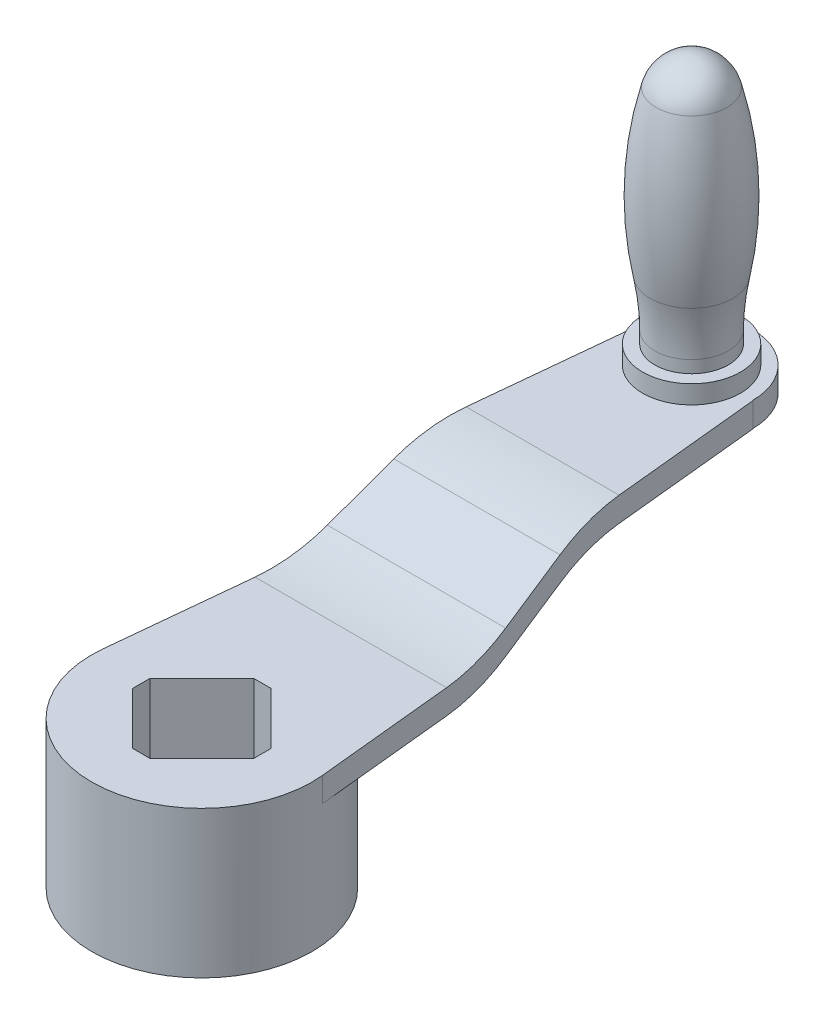
ISO-10303-21;
HEADER;
FILE_DESCRIPTION(('STEP AP214'),'2;1');
FILE_NAME('part.step','',(''),(''),'','','');
FILE_SCHEMA(('AUTOMOTIVE_DESIGN { 1 0 10303 214 1 1 1 1 }'));
ENDSEC;
DATA;
#1=APPLICATION_CONTEXT('core data for automotive mechanical design processes');
#2=APPLICATION_PROTOCOL_DEFINITION('international standard','automotive_design',2000,#1);
#3=PRODUCT_CONTEXT('',#1,'mechanical');
#4=PRODUCT('Part','Part','',(#3));
#5=PRODUCT_RELATED_PRODUCT_CATEGORY('part','',(#4));
#6=PRODUCT_DEFINITION_FORMATION('','',#4);
#7=PRODUCT_DEFINITION_CONTEXT('part definition',#1,'design');
#8=PRODUCT_DEFINITION('design','',#6,#7);
#9=PRODUCT_DEFINITION_SHAPE('','',#8);
#10=(LENGTH_UNIT() NAMED_UNIT(*) SI_UNIT(.MILLI.,.METRE.));
#11=(NAMED_UNIT(*) PLANE_ANGLE_UNIT() SI_UNIT($,.RADIAN.));
#12=(NAMED_UNIT(*) SI_UNIT($,.STERADIAN.) SOLID_ANGLE_UNIT());
#13=UNCERTAINTY_MEASURE_WITH_UNIT(LENGTH_MEASURE(1.E-05),#10,'distance_accuracy_value','');
#14=(GEOMETRIC_REPRESENTATION_CONTEXT(3) GLOBAL_UNCERTAINTY_ASSIGNED_CONTEXT((#13)) GLOBAL_UNIT_ASSIGNED_CONTEXT((#10,
#11,#12)) REPRESENTATION_CONTEXT('',''));
#15=CARTESIAN_POINT('',(0.,0.,0.));
#16=DIRECTION('',(0.,0.,1.));
#17=DIRECTION('',(1.,0.,0.));
#18=AXIS2_PLACEMENT_3D('',#15,#16,#17);
#19=CARTESIAN_POINT('',(45.,0.,-200.));
#20=DIRECTION('',(0.,0.,-1.));
#21=DIRECTION('',(-1.,0.,0.));
#22=AXIS2_PLACEMENT_3D('',#19,#20,#21);
#23=PLANE('',#22);
#24=DIRECTION('',(0.,1.,0.));
#25=VECTOR('',#24,1.);
#26=CARTESIAN_POINT('',(-25.,15.,-200.));
#27=LINE('',#26,#25);
#28=CARTESIAN_POINT('',(-25.,15.,-200.));
#29=VERTEX_POINT('',#28);
#30=CARTESIAN_POINT('',(-25.,25.,-200.));
#31=VERTEX_POINT('',#30);
#32=EDGE_CURVE('E202',#29,#31,#27,.T.);
#33=ORIENTED_EDGE('',*,*,#32,.F.);
#34=DIRECTION('',(-1.,0.,0.));
#35=VECTOR('',#34,1.);
#36=CARTESIAN_POINT('',(45.,15.,-200.));
#37=LINE('',#36,#35);
#38=CARTESIAN_POINT('',(-25.1259453814803,15.,-200.));
#39=VERTEX_POINT('',#38);
#40=EDGE_CURVE('E212',#29,#39,#37,.T.);
#41=ORIENTED_EDGE('',*,*,#40,.T.);
#42=DIRECTION('',(0.,1.,0.));
#43=VECTOR('',#42,1.);
#44=CARTESIAN_POINT('',(-25.1259453814803,-60.,-200.));
#45=LINE('',#44,#43);
#46=CARTESIAN_POINT('',(-25.1259453814803,25.,-200.));
#47=VERTEX_POINT('',#46);
#48=EDGE_CURVE('E559',#39,#47,#45,.T.);
#49=ORIENTED_EDGE('',*,*,#48,.T.);
#50=DIRECTION('',(-1.,0.,0.));
#51=VECTOR('',#50,1.);
#52=CARTESIAN_POINT('',(45.,25.,-200.));
#53=LINE('',#52,#51);
#54=EDGE_CURVE('E356',#31,#47,#53,.T.);
#55=ORIENTED_EDGE('',*,*,#54,.F.);
#56=EDGE_LOOP('',(#33,#41,#49,#55));
#57=FACE_BOUND('',#56,.T.);
#58=ADVANCED_FACE('F45',(#57),#23,.T.);
#59=CARTESIAN_POINT('',(0.,0.,0.));
#60=DIRECTION('',(0.,1.,0.));
#61=DIRECTION('',(0.,0.,1.));
#62=AXIS2_PLACEMENT_3D('',#59,#60,#61);
#63=PLANE('',#62);
#64=DIRECTION('',(-0.70710678118654,0.,-0.707106781186555));
#65=VECTOR('',#64,1.);
#66=CARTESIAN_POINT('',(24.7487373415289,0.,-3.53553390593278));
#67=LINE('',#66,#65);
#68=CARTESIAN_POINT('',(24.7487373415289,0.,-3.53553390593278));
#69=VERTEX_POINT('',#68);
#70=CARTESIAN_POINT('',(3.53553390593267,0.,-24.7487373415295));
#71=VERTEX_POINT('',#70);
#72=EDGE_CURVE('E351',#69,#71,#67,.T.);
#73=ORIENTED_EDGE('',*,*,#72,.F.);
#74=DIRECTION('',(0.,0.,-1.));
#75=VECTOR('',#74,1.);
#76=CARTESIAN_POINT('',(24.7487373415289,0.,3.53553390593283));
#77=LINE('',#76,#75);
#78=CARTESIAN_POINT('',(24.7487373415289,0.,3.53553390593283));
#79=VERTEX_POINT('',#78);
#80=EDGE_CURVE('E250',#79,#69,#77,.T.);
#81=ORIENTED_EDGE('',*,*,#80,.F.);
#82=DIRECTION('',(0.70710678118654,0.,-0.707106781186555));
#83=VECTOR('',#82,1.);
#84=CARTESIAN_POINT('',(3.53553390593269,0.,24.7487373415294));
#85=LINE('',#84,#83);
#86=CARTESIAN_POINT('',(3.53553390593269,0.,24.7487373415294));
#87=VERTEX_POINT('',#86);
#88=EDGE_CURVE('E290',#87,#79,#85,.T.);
#89=ORIENTED_EDGE('',*,*,#88,.F.);
#90=DIRECTION('',(1.,0.,0.));
#91=VECTOR('',#90,1.);
#92=CARTESIAN_POINT('',(-3.53553390593276,0.,24.7487373415295));
#93=LINE('',#92,#91);
#94=CARTESIAN_POINT('',(-3.53553390593276,0.,24.7487373415295));
#95=VERTEX_POINT('',#94);
#96=EDGE_CURVE('E286',#95,#87,#93,.T.);
#97=ORIENTED_EDGE('',*,*,#96,.F.);
#98=DIRECTION('',(0.707106781186552,0.,0.707106781186544));
#99=VECTOR('',#98,1.);
#100=CARTESIAN_POINT('',(-24.7487373415298,0.,3.53553390593266));
#101=LINE('',#100,#99);
#102=CARTESIAN_POINT('',(-24.7487373415298,0.,3.53553390593266));
#103=VERTEX_POINT('',#102);
#104=EDGE_CURVE('E282',#103,#95,#101,.T.);
#105=ORIENTED_EDGE('',*,*,#104,.F.);
#106=DIRECTION('',(0.,0.,1.));
#107=VECTOR('',#106,1.);
#108=CARTESIAN_POINT('',(-24.7487373415298,0.,3.53553390593266));
#109=LINE('',#108,#107);
#110=CARTESIAN_POINT('',(-24.7487373415298,0.,-3.53553390593272));
#111=VERTEX_POINT('',#110);
#112=EDGE_CURVE('E244',#111,#103,#109,.T.);
#113=ORIENTED_EDGE('',*,*,#112,.F.);
#114=DIRECTION('',(-0.707106781186551,0.,0.707106781186544));
#115=VECTOR('',#114,1.);
#116=CARTESIAN_POINT('',(-24.7487373415298,0.,-3.53553390593272));
#117=LINE('',#116,#115);
#118=CARTESIAN_POINT('',(-3.53553390593275,0.,-24.7487373415295));
#119=VERTEX_POINT('',#118);
#120=EDGE_CURVE('E428',#119,#111,#117,.T.);
#121=ORIENTED_EDGE('',*,*,#120,.F.);
#122=DIRECTION('',(-1.,0.,0.));
#123=VECTOR('',#122,1.);
#124=CARTESIAN_POINT('',(-3.53553390593275,0.,-24.7487373415295));
#125=LINE('',#124,#123);
#126=EDGE_CURVE('E424',#71,#119,#125,.T.);
#127=ORIENTED_EDGE('',*,*,#126,.F.);
#128=EDGE_LOOP('',(#73,#81,#89,#97,#105,#113,#121,#127));
#129=FACE_BOUND('',#128,.T.);
#130=DIRECTION('',(0.1,0.,-0.99498743710662));
#131=VECTOR('',#130,1.);
#132=CARTESIAN_POINT('',(-44.7744346697979,0.,-4.5));
#133=LINE('',#132,#131);
#134=CARTESIAN_POINT('',(-44.7744346697979,0.,-4.5));
#135=VERTEX_POINT('',#134);
#136=CARTESIAN_POINT('',(-39.1124615383748,0.,-60.8359213500124));
#137=VERTEX_POINT('',#136);
#138=EDGE_CURVE('E402',#135,#137,#133,.T.);
#139=ORIENTED_EDGE('',*,*,#138,.F.);
#140=CARTESIAN_POINT('',(0.,0.,0.));
#141=DIRECTION('',(0.,1.,0.));
#142=DIRECTION('',(0.,0.,1.));
#143=AXIS2_PLACEMENT_3D('',#140,#141,#142);
#144=CIRCLE('',#143,45.);
#145=CARTESIAN_POINT('',(44.7744346697979,0.,-4.5));
#146=VERTEX_POINT('',#145);
#147=EDGE_CURVE('E300',#135,#146,#144,.T.);
#148=ORIENTED_EDGE('',*,*,#147,.T.);
#149=DIRECTION('',(-0.1,0.,-0.99498743710662));
#150=VECTOR('',#149,1.);
#151=CARTESIAN_POINT('',(44.7744346697979,0.,-4.5));
#152=LINE('',#151,#150);
#153=CARTESIAN_POINT('',(39.1124615383748,0.,-60.8359213500124));
#154=VERTEX_POINT('',#153);
#155=EDGE_CURVE('E370',#146,#154,#152,.T.);
#156=ORIENTED_EDGE('',*,*,#155,.T.);
#157=DIRECTION('',(-1.,0.,0.));
#158=VECTOR('',#157,1.);
#159=CARTESIAN_POINT('',(45.,0.,-60.8359213500124));
#160=LINE('',#159,#158);
#161=EDGE_CURVE('E335',#154,#137,#160,.T.);
#162=ORIENTED_EDGE('',*,*,#161,.T.);
#163=EDGE_LOOP('',(#139,#148,#156,#162));
#164=FACE_BOUND('',#163,.T.);
#165=ADVANCED_FACE('F442',(#129,#164),#63,.T.);
#166=CARTESIAN_POINT('',(45.,-10.,0.));
#167=DIRECTION('',(0.,1.,0.));
#168=DIRECTION('',(0.,0.,1.));
#169=AXIS2_PLACEMENT_3D('',#166,#167,#168);
#170=PLANE('',#169);
#171=CARTESIAN_POINT('',(0.,-10.,0.));
#172=DIRECTION('',(0.,1.,0.));
#173=DIRECTION('',(0.,0.,1.));
#174=AXIS2_PLACEMENT_3D('',#171,#172,#173);
#175=CIRCLE('',#174,45.);
#176=CARTESIAN_POINT('',(-44.7744346697979,-10.,-4.5));
#177=VERTEX_POINT('',#176);
#178=CARTESIAN_POINT('',(44.7744346697979,-10.,-4.5));
#179=VERTEX_POINT('',#178);
#180=EDGE_CURVE('E240',#177,#179,#175,.F.);
#181=ORIENTED_EDGE('',*,*,#180,.F.);
#182=DIRECTION('',(0.1,0.,-0.99498743710662));
#183=VECTOR('',#182,1.);
#184=CARTESIAN_POINT('',(-44.3244346697979,-10.,-8.97744346697979));
#185=LINE('',#184,#183);
#186=CARTESIAN_POINT('',(-39.1124615383748,-10.,-60.8359213500124));
#187=VERTEX_POINT('',#186);
#188=EDGE_CURVE('E420',#177,#187,#185,.T.);
#189=ORIENTED_EDGE('',*,*,#188,.T.);
#190=DIRECTION('',(-1.,0.,0.));
#191=VECTOR('',#190,1.);
#192=CARTESIAN_POINT('',(45.,-10.,-60.8359213500124));
#193=LINE('',#192,#191);
#194=CARTESIAN_POINT('',(39.1124615383748,-10.,-60.8359213500124));
#195=VERTEX_POINT('',#194);
#196=EDGE_CURVE('E236',#195,#187,#193,.T.);
#197=ORIENTED_EDGE('',*,*,#196,.F.);
#198=DIRECTION('',(-0.1,0.,-0.99498743710662));
#199=VECTOR('',#198,1.);
#200=CARTESIAN_POINT('',(45.2244346697979,-10.,-0.0225565330202106));
#201=LINE('',#200,#199);
#202=EDGE_CURVE('E391',#179,#195,#201,.T.);
#203=ORIENTED_EDGE('',*,*,#202,.F.);
#204=EDGE_LOOP('',(#181,#189,#197,#203));
#205=FACE_BOUND('',#204,.T.);
#206=ADVANCED_FACE('F487',(#205),#170,.F.);
#207=CARTESIAN_POINT('',(45.,50.,-60.8359213500126));
#208=DIRECTION('',(-1.,0.,0.));
#209=DIRECTION('',(0.,0.,1.));
#210=AXIS2_PLACEMENT_3D('',#207,#208,#209);
#211=CYLINDRICAL_SURFACE('',#210,60.);
#212=ORIENTED_EDGE('',*,*,#196,.T.);
#213=CARTESIAN_POINT('',(-39.1124615383747,50.,-60.8359213500126));
#214=DIRECTION('',(0.99498743710662,0.,0.1));
#215=DIRECTION('',(-0.1,0.,0.99498743710662));
#216=AXIS2_PLACEMENT_3D('',#213,#214,#215);
#217=ELLIPSE('',#216,60.3022689155527,60.);
#218=CARTESIAN_POINT('',(-36.4156620885217,-3.66563145999489,-87.6687370800103));
#219=VERTEX_POINT('',#218);
#220=EDGE_CURVE('E416',#187,#219,#217,.T.);
#221=ORIENTED_EDGE('',*,*,#220,.T.);
#222=DIRECTION('',(-1.,0.,0.));
#223=VECTOR('',#222,1.);
#224=CARTESIAN_POINT('',(45.,-3.66563145999488,-87.6687370800103));
#225=LINE('',#224,#223);
#226=CARTESIAN_POINT('',(36.4156620885218,-3.66563145999488,-87.6687370800103));
#227=VERTEX_POINT('',#226);
#228=EDGE_CURVE('E232',#227,#219,#225,.T.);
#229=ORIENTED_EDGE('',*,*,#228,.F.);
#230=CARTESIAN_POINT('',(39.1124615383747,50.,-60.8359213500126));
#231=DIRECTION('',(0.99498743710662,0.,-0.1));
#232=DIRECTION('',(-0.1,0.,-0.99498743710662));
#233=AXIS2_PLACEMENT_3D('',#230,#231,#232);
#234=ELLIPSE('',#233,60.3022689155527,60.);
#235=EDGE_CURVE('E388',#195,#227,#234,.T.);
#236=ORIENTED_EDGE('',*,*,#235,.F.);
#237=EDGE_LOOP('',(#212,#221,#229,#236));
#238=FACE_BOUND('',#237,.T.);
#239=ADVANCED_FACE('F507',(#238),#211,.T.);
#240=CARTESIAN_POINT('',(45.,-38.,-19.));
#241=DIRECTION('',(0.,0.894427190999916,0.447213595499958));
#242=DIRECTION('',(0.,-0.447213595499958,0.894427190999916));
#243=AXIS2_PLACEMENT_3D('',#240,#241,#242);
#244=PLANE('',#243);
#245=ORIENTED_EDGE('',*,*,#228,.T.);
#246=DIRECTION('',(0.0895322962071691,0.445417549707209,-0.890835099414419));
#247=VECTOR('',#246,1.);
#248=CARTESIAN_POINT('',(-42.6091768930815,-34.4779785703488,-26.0440428593024));
#249=LINE('',#248,#247);
#250=CARTESIAN_POINT('',(-33.936984979623,8.66563145999483,-112.33126291999));
#251=VERTEX_POINT('',#250);
#252=EDGE_CURVE('E412',#219,#251,#249,.T.);
#253=ORIENTED_EDGE('',*,*,#252,.T.);
#254=DIRECTION('',(-1.,0.,0.));
#255=VECTOR('',#254,1.);
#256=CARTESIAN_POINT('',(45.,8.66563145999483,-112.33126291999));
#257=LINE('',#256,#255);
#258=CARTESIAN_POINT('',(33.9369849796231,8.66563145999483,-112.33126291999));
#259=VERTEX_POINT('',#258);
#260=EDGE_CURVE('E223',#259,#251,#257,.T.);
#261=ORIENTED_EDGE('',*,*,#260,.F.);
#262=DIRECTION('',(-0.0895322962071691,0.445417549707209,-0.890835099414419));
#263=VECTOR('',#262,1.);
#264=CARTESIAN_POINT('',(43.330619778853,-38.0671116100119,-18.8657767799761));
#265=LINE('',#264,#263);
#266=EDGE_CURVE('E385',#227,#259,#265,.T.);
#267=ORIENTED_EDGE('',*,*,#266,.F.);
#268=EDGE_LOOP('',(#245,#253,#261,#267));
#269=FACE_BOUND('',#268,.T.);
#270=ADVANCED_FACE('F501',(#269),#244,.F.);
#271=CARTESIAN_POINT('',(45.,-45.,-139.164078649987));
#272=DIRECTION('',(-1.,0.,0.));
#273=DIRECTION('',(0.,0.,1.));
#274=AXIS2_PLACEMENT_3D('',#271,#272,#273);
#275=CYLINDRICAL_SURFACE('',#274,60.);
#276=ORIENTED_EDGE('',*,*,#260,.T.);
#277=CARTESIAN_POINT('',(-31.2401855297701,-45.,-139.164078649987));
#278=DIRECTION('',(0.99498743710662,0.,0.1));
#279=DIRECTION('',(-0.1,0.,0.99498743710662));
#280=AXIS2_PLACEMENT_3D('',#277,#278,#279);
#281=ELLIPSE('',#280,60.3022689155527,60.);
#282=CARTESIAN_POINT('',(-31.2401855297701,15.,-139.164078649988));
#283=VERTEX_POINT('',#282);
#284=EDGE_CURVE('E408',#251,#283,#281,.F.);
#285=ORIENTED_EDGE('',*,*,#284,.T.);
#286=DIRECTION('',(-1.,0.,0.));
#287=VECTOR('',#286,1.);
#288=CARTESIAN_POINT('',(45.,15.,-139.164078649988));
#289=LINE('',#288,#287);
#290=CARTESIAN_POINT('',(31.2401855297701,15.,-139.164078649988));
#291=VERTEX_POINT('',#290);
#292=EDGE_CURVE('E219',#291,#283,#289,.T.);
#293=ORIENTED_EDGE('',*,*,#292,.F.);
#294=CARTESIAN_POINT('',(31.2401855297701,-45.,-139.164078649987));
#295=DIRECTION('',(0.99498743710662,0.,-0.1));
#296=DIRECTION('',(-0.1,0.,-0.99498743710662));
#297=AXIS2_PLACEMENT_3D('',#294,#295,#296);
#298=ELLIPSE('',#297,60.3022689155527,60.);
#299=EDGE_CURVE('E382',#259,#291,#298,.F.);
#300=ORIENTED_EDGE('',*,*,#299,.F.);
#301=EDGE_LOOP('',(#276,#285,#293,#300));
#302=FACE_BOUND('',#301,.T.);
#303=ADVANCED_FACE('F497',(#302),#275,.F.);
#304=CARTESIAN_POINT('',(45.,15.,0.));
#305=DIRECTION('',(0.,1.,0.));
#306=DIRECTION('',(0.,0.,1.));
#307=AXIS2_PLACEMENT_3D('',#304,#305,#306);
#308=PLANE('',#307);
#309=ORIENTED_EDGE('',*,*,#292,.T.);
#310=DIRECTION('',(0.1,0.,-0.99498743710662));
#311=VECTOR('',#310,1.);
#312=CARTESIAN_POINT('',(-44.3244346697979,15.,-8.97744346697979));
#313=LINE('',#312,#311);
#314=EDGE_CURVE('E405',#283,#39,#313,.T.);
#315=ORIENTED_EDGE('',*,*,#314,.T.);
#316=ORIENTED_EDGE('',*,*,#40,.F.);
#317=CARTESIAN_POINT('',(0.,15.,-200.));
#318=DIRECTION('',(0.,1.,0.));
#319=DIRECTION('',(0.,0.,1.));
#320=AXIS2_PLACEMENT_3D('',#317,#318,#319);
#321=CIRCLE('',#320,25.);
#322=CARTESIAN_POINT('',(25.,15.,-200.));
#323=VERTEX_POINT('',#322);
#324=EDGE_CURVE('E196',#323,#29,#321,.T.);
#325=ORIENTED_EDGE('',*,*,#324,.F.);
#326=CARTESIAN_POINT('',(25.1259453814803,15.,-200.));
#327=VERTEX_POINT('',#326);
#328=EDGE_CURVE('E210',#327,#323,#37,.T.);
#329=ORIENTED_EDGE('',*,*,#328,.F.);
#330=DIRECTION('',(-0.1,0.,-0.99498743710662));
#331=VECTOR('',#330,1.);
#332=CARTESIAN_POINT('',(45.2244346697979,15.,-0.0225565330202106));
#333=LINE('',#332,#331);
#334=EDGE_CURVE('E375',#291,#327,#333,.T.);
#335=ORIENTED_EDGE('',*,*,#334,.F.);
#336=EDGE_LOOP('',(#309,#315,#316,#325,#329,#335));
#337=FACE_BOUND('',#336,.T.);
#338=ADVANCED_FACE('F208',(#337),#308,.F.);
#339=DIRECTION('',(0.,1.,0.));
#340=VECTOR('',#339,1.);
#341=CARTESIAN_POINT('',(25.,15.,-200.));
#342=LINE('',#341,#340);
#343=CARTESIAN_POINT('',(25.,25.,-200.));
#344=VERTEX_POINT('',#343);
#345=EDGE_CURVE('E193',#323,#344,#342,.T.);
#346=ORIENTED_EDGE('',*,*,#345,.T.);
#347=CARTESIAN_POINT('',(25.1259453814803,25.,-200.));
#348=VERTEX_POINT('',#347);
#349=EDGE_CURVE('E225',#348,#344,#53,.T.);
#350=ORIENTED_EDGE('',*,*,#349,.F.);
#351=DIRECTION('',(0.,1.,0.));
#352=VECTOR('',#351,1.);
#353=CARTESIAN_POINT('',(25.1259453814803,-60.,-200.));
#354=LINE('',#353,#352);
#355=EDGE_CURVE('E217',#327,#348,#354,.T.);
#356=ORIENTED_EDGE('',*,*,#355,.F.);
#357=ORIENTED_EDGE('',*,*,#328,.T.);
#358=EDGE_LOOP('',(#346,#350,#356,#357));
#359=FACE_BOUND('',#358,.T.);
#360=ADVANCED_FACE('F216',(#359),#23,.T.);
#361=CARTESIAN_POINT('',(45.,25.,0.));
#362=DIRECTION('',(0.,1.,0.));
#363=DIRECTION('',(0.,0.,1.));
#364=AXIS2_PLACEMENT_3D('',#361,#362,#363);
#365=PLANE('',#364);
#366=CARTESIAN_POINT('',(0.,25.,-200.));
#367=DIRECTION('',(0.,1.,0.));
#368=DIRECTION('',(0.,0.,1.));
#369=AXIS2_PLACEMENT_3D('',#366,#367,#368);
#370=CIRCLE('',#369,20.);
#371=CARTESIAN_POINT('',(0.,25.,-180.));
#372=VERTEX_POINT('',#371);
#373=EDGE_CURVE('E571',#372,#372,#370,.T.);
#374=ORIENTED_EDGE('',*,*,#373,.F.);
#375=EDGE_LOOP('',(#374));
#376=FACE_BOUND('',#375,.T.);
#377=DIRECTION('',(0.1,0.,-0.99498743710662));
#378=VECTOR('',#377,1.);
#379=CARTESIAN_POINT('',(-44.3244346697979,25.,-8.97744346697979));
#380=LINE('',#379,#378);
#381=CARTESIAN_POINT('',(-31.24018552977,25.,-139.164078649988));
#382=VERTEX_POINT('',#381);
#383=EDGE_CURVE('E399',#382,#47,#380,.T.);
#384=ORIENTED_EDGE('',*,*,#383,.F.);
#385=DIRECTION('',(-1.,0.,0.));
#386=VECTOR('',#385,1.);
#387=CARTESIAN_POINT('',(45.,25.,-139.164078649988));
#388=LINE('',#387,#386);
#389=CARTESIAN_POINT('',(31.2401855297701,25.,-139.164078649988));
#390=VERTEX_POINT('',#389);
#391=EDGE_CURVE('E349',#390,#382,#388,.T.);
#392=ORIENTED_EDGE('',*,*,#391,.F.);
#393=DIRECTION('',(-0.1,0.,-0.99498743710662));
#394=VECTOR('',#393,1.);
#395=CARTESIAN_POINT('',(45.2244346697979,25.,-0.0225565330202106));
#396=LINE('',#395,#394);
#397=EDGE_CURVE('E368',#390,#348,#396,.T.);
#398=ORIENTED_EDGE('',*,*,#397,.T.);
#399=ORIENTED_EDGE('',*,*,#349,.T.);
#400=CARTESIAN_POINT('',(0.,25.,-200.));
#401=DIRECTION('',(0.,1.,0.));
#402=DIRECTION('',(0.,0.,1.));
#403=AXIS2_PLACEMENT_3D('',#400,#401,#402);
#404=CIRCLE('',#403,25.);
#405=EDGE_CURVE('E61',#344,#31,#404,.T.);
#406=ORIENTED_EDGE('',*,*,#405,.T.);
#407=ORIENTED_EDGE('',*,*,#54,.T.);
#408=EDGE_LOOP('',(#384,#392,#398,#399,#406,#407));
#409=FACE_BOUND('',#408,.T.);
#410=ADVANCED_FACE('F367',(#376,#409),#365,.T.);
#411=CARTESIAN_POINT('',(45.,-35.,-139.164078649987));
#412=DIRECTION('',(-1.,0.,0.));
#413=DIRECTION('',(0.,0.,1.));
#414=AXIS2_PLACEMENT_3D('',#411,#412,#413);
#415=CYLINDRICAL_SURFACE('',#414,60.);
#416=CARTESIAN_POINT('',(-31.2401855297701,-35.,-139.164078649987));
#417=DIRECTION('',(0.99498743710662,0.,0.1));
#418=DIRECTION('',(-0.1,0.,0.99498743710662));
#419=AXIS2_PLACEMENT_3D('',#416,#417,#418);
#420=ELLIPSE('',#419,60.3022689155527,60.);
#421=CARTESIAN_POINT('',(-33.9369849796231,18.6656314599949,-112.33126291999));
#422=VERTEX_POINT('',#421);
#423=EDGE_CURVE('E396',#422,#382,#420,.F.);
#424=ORIENTED_EDGE('',*,*,#423,.F.);
#425=DIRECTION('',(-1.,0.,0.));
#426=VECTOR('',#425,1.);
#427=CARTESIAN_POINT('',(45.,18.6656314599948,-112.33126291999));
#428=LINE('',#427,#426);
#429=CARTESIAN_POINT('',(33.9369849796231,18.6656314599949,-112.33126291999));
#430=VERTEX_POINT('',#429);
#431=EDGE_CURVE('E345',#430,#422,#428,.T.);
#432=ORIENTED_EDGE('',*,*,#431,.F.);
#433=CARTESIAN_POINT('',(31.2401855297701,-35.,-139.164078649987));
#434=DIRECTION('',(0.99498743710662,0.,-0.1));
#435=DIRECTION('',(-0.1,0.,-0.99498743710662));
#436=AXIS2_PLACEMENT_3D('',#433,#434,#435);
#437=ELLIPSE('',#436,60.3022689155527,60.);
#438=EDGE_CURVE('E371',#430,#390,#437,.F.);
#439=ORIENTED_EDGE('',*,*,#438,.T.);
#440=ORIENTED_EDGE('',*,*,#391,.T.);
#441=EDGE_LOOP('',(#424,#432,#439,#440));
#442=FACE_BOUND('',#441,.T.);
#443=ADVANCED_FACE('F495',(#442),#415,.T.);
#444=CARTESIAN_POINT('',(45.,-30.,-15.));
#445=DIRECTION('',(0.,0.894427190999916,0.447213595499958));
#446=DIRECTION('',(0.,-0.447213595499958,0.894427190999916));
#447=AXIS2_PLACEMENT_3D('',#444,#445,#446);
#448=PLANE('',#447);
#449=DIRECTION('',(0.0895322962071691,0.445417549707209,-0.890835099414419));
#450=VECTOR('',#449,1.);
#451=CARTESIAN_POINT('',(-43.0079694530441,-26.4619465062205,-22.076106987559));
#452=LINE('',#451,#450);
#453=CARTESIAN_POINT('',(-36.4156620885217,6.33436854000514,-87.6687370800103));
#454=VERTEX_POINT('',#453);
#455=EDGE_CURVE('E343',#454,#422,#452,.T.);
#456=ORIENTED_EDGE('',*,*,#455,.F.);
#457=DIRECTION('',(-1.,0.,0.));
#458=VECTOR('',#457,1.);
#459=CARTESIAN_POINT('',(45.,6.33436854000514,-87.6687370800103));
#460=LINE('',#459,#458);
#461=CARTESIAN_POINT('',(36.4156620885218,6.33436854000514,-87.6687370800103));
#462=VERTEX_POINT('',#461);
#463=EDGE_CURVE('E333',#462,#454,#460,.T.);
#464=ORIENTED_EDGE('',*,*,#463,.F.);
#465=DIRECTION('',(-0.0895322962071691,0.445417549707209,-0.890835099414419));
#466=VECTOR('',#465,1.);
#467=CARTESIAN_POINT('',(43.7294123388156,-30.0510795458837,-14.8978409082326));
#468=LINE('',#467,#466);
#469=EDGE_CURVE('E69',#462,#430,#468,.T.);
#470=ORIENTED_EDGE('',*,*,#469,.T.);
#471=ORIENTED_EDGE('',*,*,#431,.T.);
#472=EDGE_LOOP('',(#456,#464,#470,#471));
#473=FACE_BOUND('',#472,.T.);
#474=ADVANCED_FACE('F340',(#473),#448,.T.);
#475=CARTESIAN_POINT('',(45.,60.,-60.8359213500126));
#476=DIRECTION('',(-1.,0.,0.));
#477=DIRECTION('',(0.,0.,1.));
#478=AXIS2_PLACEMENT_3D('',#475,#476,#477);
#479=CYLINDRICAL_SURFACE('',#478,60.);
#480=CARTESIAN_POINT('',(-39.1124615383747,60.,-60.8359213500126));
#481=DIRECTION('',(0.99498743710662,0.,0.1));
#482=DIRECTION('',(-0.1,0.,0.99498743710662));
#483=AXIS2_PLACEMENT_3D('',#480,#481,#482);
#484=ELLIPSE('',#483,60.3022689155527,60.);
#485=EDGE_CURVE('E11',#137,#454,#484,.T.);
#486=ORIENTED_EDGE('',*,*,#485,.F.);
#487=ORIENTED_EDGE('',*,*,#161,.F.);
#488=CARTESIAN_POINT('',(39.1124615383747,60.,-60.8359213500126));
#489=DIRECTION('',(0.99498743710662,0.,-0.1));
#490=DIRECTION('',(-0.1,0.,-0.99498743710662));
#491=AXIS2_PLACEMENT_3D('',#488,#489,#490);
#492=ELLIPSE('',#491,60.3022689155527,60.);
#493=EDGE_CURVE('E54',#154,#462,#492,.T.);
#494=ORIENTED_EDGE('',*,*,#493,.T.);
#495=ORIENTED_EDGE('',*,*,#463,.T.);
#496=EDGE_LOOP('',(#486,#487,#494,#495));
#497=FACE_BOUND('',#496,.T.);
#498=ADVANCED_FACE('F332',(#497),#479,.F.);
#499=CARTESIAN_POINT('',(0.,-60.,0.));
#500=DIRECTION('',(0.,1.,0.));
#501=DIRECTION('',(0.,0.,1.));
#502=AXIS2_PLACEMENT_3D('',#499,#500,#501);
#503=CYLINDRICAL_SURFACE('',#502,45.);
#504=CARTESIAN_POINT('',(0.,-60.,0.));
#505=DIRECTION('',(0.,1.,0.));
#506=DIRECTION('',(0.,0.,1.));
#507=AXIS2_PLACEMENT_3D('',#504,#505,#506);
#508=CIRCLE('',#507,45.);
#509=CARTESIAN_POINT('',(0.,-60.,45.));
#510=VERTEX_POINT('',#509);
#511=EDGE_CURVE('E321',#510,#510,#508,.T.);
#512=ORIENTED_EDGE('',*,*,#511,.T.);
#513=EDGE_LOOP('',(#512));
#514=FACE_BOUND('',#513,.T.);
#515=DIRECTION('',(0.,1.,0.));
#516=VECTOR('',#515,1.);
#517=CARTESIAN_POINT('',(44.7744346697979,-60.,-4.5));
#518=LINE('',#517,#516);
#519=EDGE_CURVE('E549',#179,#146,#518,.T.);
#520=ORIENTED_EDGE('',*,*,#519,.T.);
#521=ORIENTED_EDGE('',*,*,#147,.F.);
#522=DIRECTION('',(0.,1.,0.));
#523=VECTOR('',#522,1.);
#524=CARTESIAN_POINT('',(-44.7744346697979,-60.,-4.5));
#525=LINE('',#524,#523);
#526=EDGE_CURVE('E555',#177,#135,#525,.T.);
#527=ORIENTED_EDGE('',*,*,#526,.F.);
#528=ORIENTED_EDGE('',*,*,#180,.T.);
#529=EDGE_LOOP('',(#520,#521,#527,#528));
#530=FACE_BOUND('',#529,.T.);
#531=ADVANCED_FACE('F47',(#514,#530),#503,.T.);
#532=CARTESIAN_POINT('',(-3.53553390593275,-60.,-24.7487373415295));
#533=DIRECTION('',(0.,0.,-1.));
#534=DIRECTION('',(-1.,0.,0.));
#535=AXIS2_PLACEMENT_3D('',#532,#533,#534);
#536=PLANE('',#535);
#537=DIRECTION('',(0.,1.,0.));
#538=VECTOR('',#537,1.);
#539=CARTESIAN_POINT('',(3.53553390593267,-60.,-24.7487373415295));
#540=LINE('',#539,#538);
#541=CARTESIAN_POINT('',(3.53553390593267,-60.,-24.7487373415295));
#542=VERTEX_POINT('',#541);
#543=EDGE_CURVE('E297',#542,#71,#540,.T.);
#544=ORIENTED_EDGE('',*,*,#543,.T.);
#545=ORIENTED_EDGE('',*,*,#126,.T.);
#546=DIRECTION('',(0.,1.,0.));
#547=VECTOR('',#546,1.);
#548=CARTESIAN_POINT('',(-3.53553390593275,-60.,-24.7487373415295));
#549=LINE('',#548,#547);
#550=CARTESIAN_POINT('',(-3.53553390593275,-60.,-24.7487373415295));
#551=VERTEX_POINT('',#550);
#552=EDGE_CURVE('E278',#551,#119,#549,.T.);
#553=ORIENTED_EDGE('',*,*,#552,.F.);
#554=DIRECTION('',(-1.,0.,0.));
#555=VECTOR('',#554,1.);
#556=CARTESIAN_POINT('',(-3.53553390593275,-60.,-24.7487373415295));
#557=LINE('',#556,#555);
#558=EDGE_CURVE('E245',#542,#551,#557,.T.);
#559=ORIENTED_EDGE('',*,*,#558,.F.);
#560=EDGE_LOOP('',(#544,#545,#553,#559));
#561=FACE_BOUND('',#560,.T.);
#562=ADVANCED_FACE('F446',(#561),#536,.F.);
#563=CARTESIAN_POINT('',(24.7487373415289,-60.,-3.53553390593278));
#564=DIRECTION('',(0.707106781186555,0.,-0.70710678118654));
#565=DIRECTION('',(-0.70710678118654,0.,-0.707106781186555));
#566=AXIS2_PLACEMENT_3D('',#563,#564,#565);
#567=PLANE('',#566);
#568=DIRECTION('',(0.,1.,0.));
#569=VECTOR('',#568,1.);
#570=CARTESIAN_POINT('',(24.7487373415289,-60.,-3.53553390593278));
#571=LINE('',#570,#569);
#572=CARTESIAN_POINT('',(24.7487373415289,-60.,-3.53553390593278));
#573=VERTEX_POINT('',#572);
#574=EDGE_CURVE('E301',#573,#69,#571,.T.);
#575=ORIENTED_EDGE('',*,*,#574,.T.);
#576=ORIENTED_EDGE('',*,*,#72,.T.);
#577=ORIENTED_EDGE('',*,*,#543,.F.);
#578=DIRECTION('',(-0.70710678118654,0.,-0.707106781186555));
#579=VECTOR('',#578,1.);
#580=CARTESIAN_POINT('',(24.7487373415289,-60.,-3.53553390593278));
#581=LINE('',#580,#579);
#582=EDGE_CURVE('E274',#573,#542,#581,.T.);
#583=ORIENTED_EDGE('',*,*,#582,.F.);
#584=EDGE_LOOP('',(#575,#576,#577,#583));
#585=FACE_BOUND('',#584,.T.);
#586=ADVANCED_FACE('F436',(#585),#567,.F.);
#587=CARTESIAN_POINT('',(-24.7487373415298,-60.,-3.53553390593272));
#588=DIRECTION('',(-0.707106781186544,0.,-0.707106781186551));
#589=DIRECTION('',(-0.707106781186551,0.,0.707106781186544));
#590=AXIS2_PLACEMENT_3D('',#587,#588,#589);
#591=PLANE('',#590);
#592=ORIENTED_EDGE('',*,*,#552,.T.);
#593=ORIENTED_EDGE('',*,*,#120,.T.);
#594=DIRECTION('',(0.,1.,0.));
#595=VECTOR('',#594,1.);
#596=CARTESIAN_POINT('',(-24.7487373415298,-60.,-3.53553390593272));
#597=LINE('',#596,#595);
#598=CARTESIAN_POINT('',(-24.7487373415298,-60.,-3.53553390593272));
#599=VERTEX_POINT('',#598);
#600=EDGE_CURVE('E316',#599,#111,#597,.T.);
#601=ORIENTED_EDGE('',*,*,#600,.F.);
#602=DIRECTION('',(-0.707106781186551,0.,0.707106781186544));
#603=VECTOR('',#602,1.);
#604=CARTESIAN_POINT('',(-24.7487373415298,-60.,-3.53553390593272));
#605=LINE('',#604,#603);
#606=EDGE_CURVE('E249',#551,#599,#605,.T.);
#607=ORIENTED_EDGE('',*,*,#606,.F.);
#608=EDGE_LOOP('',(#592,#593,#601,#607));
#609=FACE_BOUND('',#608,.T.);
#610=ADVANCED_FACE('F470',(#609),#591,.F.);
#611=CARTESIAN_POINT('',(0.,-60.,0.));
#612=DIRECTION('',(0.,1.,0.));
#613=DIRECTION('',(0.,0.,1.));
#614=AXIS2_PLACEMENT_3D('',#611,#612,#613);
#615=PLANE('',#614);
#616=ORIENTED_EDGE('',*,*,#582,.T.);
#617=ORIENTED_EDGE('',*,*,#558,.T.);
#618=ORIENTED_EDGE('',*,*,#606,.T.);
#619=DIRECTION('',(0.,0.,1.));
#620=VECTOR('',#619,1.);
#621=CARTESIAN_POINT('',(-24.7487373415298,-60.,3.53553390593266));
#622=LINE('',#621,#620);
#623=CARTESIAN_POINT('',(-24.7487373415298,-60.,3.53553390593266));
#624=VERTEX_POINT('',#623);
#625=EDGE_CURVE('E254',#599,#624,#622,.T.);
#626=ORIENTED_EDGE('',*,*,#625,.T.);
#627=DIRECTION('',(0.707106781186552,0.,0.707106781186544));
#628=VECTOR('',#627,1.);
#629=CARTESIAN_POINT('',(-24.7487373415298,-60.,3.53553390593266));
#630=LINE('',#629,#628);
#631=CARTESIAN_POINT('',(-3.53553390593276,-60.,24.7487373415295));
#632=VERTEX_POINT('',#631);
#633=EDGE_CURVE('E258',#624,#632,#630,.T.);
#634=ORIENTED_EDGE('',*,*,#633,.T.);
#635=DIRECTION('',(1.,0.,0.));
#636=VECTOR('',#635,1.);
#637=CARTESIAN_POINT('',(-3.53553390593276,-60.,24.7487373415295));
#638=LINE('',#637,#636);
#639=CARTESIAN_POINT('',(3.53553390593269,-60.,24.7487373415294));
#640=VERTEX_POINT('',#639);
#641=EDGE_CURVE('E262',#632,#640,#638,.T.);
#642=ORIENTED_EDGE('',*,*,#641,.T.);
#643=DIRECTION('',(0.70710678118654,0.,-0.707106781186555));
#644=VECTOR('',#643,1.);
#645=CARTESIAN_POINT('',(3.53553390593269,-60.,24.7487373415294));
#646=LINE('',#645,#644);
#647=CARTESIAN_POINT('',(24.7487373415289,-60.,3.53553390593283));
#648=VERTEX_POINT('',#647);
#649=EDGE_CURVE('E266',#640,#648,#646,.T.);
#650=ORIENTED_EDGE('',*,*,#649,.T.);
#651=DIRECTION('',(0.,0.,-1.));
#652=VECTOR('',#651,1.);
#653=CARTESIAN_POINT('',(24.7487373415289,-60.,3.53553390593283));
#654=LINE('',#653,#652);
#655=EDGE_CURVE('E270',#648,#573,#654,.T.);
#656=ORIENTED_EDGE('',*,*,#655,.T.);
#657=EDGE_LOOP('',(#616,#617,#618,#626,#634,#642,#650,#656));
#658=FACE_BOUND('',#657,.T.);
#659=ORIENTED_EDGE('',*,*,#511,.F.);
#660=EDGE_LOOP('',(#659));
#661=FACE_BOUND('',#660,.T.);
#662=ADVANCED_FACE('F449',(#658,#661),#615,.F.);
#663=CARTESIAN_POINT('',(24.7487373415289,-60.,3.53553390593283));
#664=DIRECTION('',(1.,0.,0.));
#665=DIRECTION('',(0.,0.,-1.));
#666=AXIS2_PLACEMENT_3D('',#663,#664,#665);
#667=PLANE('',#666);
#668=ORIENTED_EDGE('',*,*,#80,.T.);
#669=ORIENTED_EDGE('',*,*,#574,.F.);
#670=ORIENTED_EDGE('',*,*,#655,.F.);
#671=DIRECTION('',(0.,1.,0.));
#672=VECTOR('',#671,1.);
#673=CARTESIAN_POINT('',(24.7487373415289,-60.,3.53553390593283));
#674=LINE('',#673,#672);
#675=EDGE_CURVE('E304',#648,#79,#674,.T.);
#676=ORIENTED_EDGE('',*,*,#675,.T.);
#677=EDGE_LOOP('',(#668,#669,#670,#676));
#678=FACE_BOUND('',#677,.T.);
#679=ADVANCED_FACE('F454',(#678),#667,.F.);
#680=CARTESIAN_POINT('',(3.53553390593269,-60.,24.7487373415294));
#681=DIRECTION('',(0.707106781186555,0.,0.70710678118654));
#682=DIRECTION('',(0.70710678118654,0.,-0.707106781186555));
#683=AXIS2_PLACEMENT_3D('',#680,#681,#682);
#684=PLANE('',#683);
#685=ORIENTED_EDGE('',*,*,#88,.T.);
#686=ORIENTED_EDGE('',*,*,#675,.F.);
#687=ORIENTED_EDGE('',*,*,#649,.F.);
#688=DIRECTION('',(0.,1.,0.));
#689=VECTOR('',#688,1.);
#690=CARTESIAN_POINT('',(3.53553390593269,-60.,24.7487373415294));
#691=LINE('',#690,#689);
#692=EDGE_CURVE('E307',#640,#87,#691,.T.);
#693=ORIENTED_EDGE('',*,*,#692,.T.);
#694=EDGE_LOOP('',(#685,#686,#687,#693));
#695=FACE_BOUND('',#694,.T.);
#696=ADVANCED_FACE('F459',(#695),#684,.F.);
#697=CARTESIAN_POINT('',(-3.53553390593276,-60.,24.7487373415295));
#698=DIRECTION('',(0.,0.,1.));
#699=DIRECTION('',(1.,0.,0.));
#700=AXIS2_PLACEMENT_3D('',#697,#698,#699);
#701=PLANE('',#700);
#702=ORIENTED_EDGE('',*,*,#96,.T.);
#703=ORIENTED_EDGE('',*,*,#692,.F.);
#704=ORIENTED_EDGE('',*,*,#641,.F.);
#705=DIRECTION('',(0.,1.,0.));
#706=VECTOR('',#705,1.);
#707=CARTESIAN_POINT('',(-3.53553390593276,-60.,24.7487373415295));
#708=LINE('',#707,#706);
#709=EDGE_CURVE('E310',#632,#95,#708,.T.);
#710=ORIENTED_EDGE('',*,*,#709,.T.);
#711=EDGE_LOOP('',(#702,#703,#704,#710));
#712=FACE_BOUND('',#711,.T.);
#713=ADVANCED_FACE('F462',(#712),#701,.F.);
#714=CARTESIAN_POINT('',(-24.7487373415298,-60.,3.53553390593266));
#715=DIRECTION('',(-0.707106781186544,0.,0.707106781186551));
#716=DIRECTION('',(0.707106781186551,0.,0.707106781186544));
#717=AXIS2_PLACEMENT_3D('',#714,#715,#716);
#718=PLANE('',#717);
#719=ORIENTED_EDGE('',*,*,#104,.T.);
#720=ORIENTED_EDGE('',*,*,#709,.F.);
#721=ORIENTED_EDGE('',*,*,#633,.F.);
#722=DIRECTION('',(0.,1.,0.));
#723=VECTOR('',#722,1.);
#724=CARTESIAN_POINT('',(-24.7487373415298,-60.,3.53553390593266));
#725=LINE('',#724,#723);
#726=EDGE_CURVE('E313',#624,#103,#725,.T.);
#727=ORIENTED_EDGE('',*,*,#726,.T.);
#728=EDGE_LOOP('',(#719,#720,#721,#727));
#729=FACE_BOUND('',#728,.T.);
#730=ADVANCED_FACE('F465',(#729),#718,.F.);
#731=CARTESIAN_POINT('',(-24.7487373415298,-60.,3.53553390593266));
#732=DIRECTION('',(-1.,0.,0.));
#733=DIRECTION('',(0.,0.,1.));
#734=AXIS2_PLACEMENT_3D('',#731,#732,#733);
#735=PLANE('',#734);
#736=ORIENTED_EDGE('',*,*,#112,.T.);
#737=ORIENTED_EDGE('',*,*,#726,.F.);
#738=ORIENTED_EDGE('',*,*,#625,.F.);
#739=ORIENTED_EDGE('',*,*,#600,.T.);
#740=EDGE_LOOP('',(#736,#737,#738,#739));
#741=FACE_BOUND('',#740,.T.);
#742=ADVANCED_FACE('F467',(#741),#735,.F.);
#743=CARTESIAN_POINT('',(-44.7744346697979,-60.,-4.5));
#744=DIRECTION('',(0.99498743710662,0.,0.1));
#745=DIRECTION('',(0.1,0.,-0.99498743710662));
#746=AXIS2_PLACEMENT_3D('',#743,#744,#745);
#747=PLANE('',#746);
#748=ORIENTED_EDGE('',*,*,#526,.T.);
#749=ORIENTED_EDGE('',*,*,#138,.T.);
#750=ORIENTED_EDGE('',*,*,#485,.T.);
#751=ORIENTED_EDGE('',*,*,#455,.T.);
#752=ORIENTED_EDGE('',*,*,#423,.T.);
#753=ORIENTED_EDGE('',*,*,#383,.T.);
#754=ORIENTED_EDGE('',*,*,#48,.F.);
#755=ORIENTED_EDGE('',*,*,#314,.F.);
#756=ORIENTED_EDGE('',*,*,#284,.F.);
#757=ORIENTED_EDGE('',*,*,#252,.F.);
#758=ORIENTED_EDGE('',*,*,#220,.F.);
#759=ORIENTED_EDGE('',*,*,#188,.F.);
#760=EDGE_LOOP('',(#748,#749,#750,#751,#752,#753,#754,#755,#756,#757,#758,#759));
#761=FACE_BOUND('',#760,.T.);
#762=ADVANCED_FACE('F523',(#761),#747,.F.);
#763=CARTESIAN_POINT('',(44.7744346697979,-60.,-4.5));
#764=DIRECTION('',(0.99498743710662,0.,-0.1));
#765=DIRECTION('',(-0.1,0.,-0.99498743710662));
#766=AXIS2_PLACEMENT_3D('',#763,#764,#765);
#767=PLANE('',#766);
#768=ORIENTED_EDGE('',*,*,#202,.T.);
#769=ORIENTED_EDGE('',*,*,#235,.T.);
#770=ORIENTED_EDGE('',*,*,#266,.T.);
#771=ORIENTED_EDGE('',*,*,#299,.T.);
#772=ORIENTED_EDGE('',*,*,#334,.T.);
#773=ORIENTED_EDGE('',*,*,#355,.T.);
#774=ORIENTED_EDGE('',*,*,#397,.F.);
#775=ORIENTED_EDGE('',*,*,#438,.F.);
#776=ORIENTED_EDGE('',*,*,#469,.F.);
#777=ORIENTED_EDGE('',*,*,#493,.F.);
#778=ORIENTED_EDGE('',*,*,#155,.F.);
#779=ORIENTED_EDGE('',*,*,#519,.F.);
#780=EDGE_LOOP('',(#768,#769,#770,#771,#772,#773,#774,#775,#776,#777,#778,#779));
#781=FACE_BOUND('',#780,.T.);
#782=ADVANCED_FACE('F527',(#781),#767,.T.);
#783=CARTESIAN_POINT('',(0.,15.,-200.));
#784=DIRECTION('',(0.,1.,0.));
#785=DIRECTION('',(0.,0.,1.));
#786=AXIS2_PLACEMENT_3D('',#783,#784,#785);
#787=CYLINDRICAL_SURFACE('',#786,25.);
#788=ORIENTED_EDGE('',*,*,#405,.F.);
#789=ORIENTED_EDGE('',*,*,#345,.F.);
#790=ORIENTED_EDGE('',*,*,#324,.T.);
#791=ORIENTED_EDGE('',*,*,#32,.T.);
#792=EDGE_LOOP('',(#788,#789,#790,#791));
#793=FACE_BOUND('',#792,.T.);
#794=ADVANCED_FACE('F195',(#793),#787,.T.);
#795=CARTESIAN_POINT('',(0.,32.5,-200.));
#796=DIRECTION('',(0.,-1.,0.));
#797=DIRECTION('',(0.,0.,-1.));
#798=AXIS2_PLACEMENT_3D('',#795,#796,#797);
#799=CYLINDRICAL_SURFACE('',#798,20.);
#800=CARTESIAN_POINT('',(0.,32.5,-200.));
#801=DIRECTION('',(0.,1.,0.));
#802=DIRECTION('',(0.,0.,1.));
#803=AXIS2_PLACEMENT_3D('',#800,#801,#802);
#804=CIRCLE('',#803,20.);
#805=CARTESIAN_POINT('',(0.,32.5,-180.));
#806=VERTEX_POINT('',#805);
#807=EDGE_CURVE('E569',#806,#806,#804,.T.);
#808=ORIENTED_EDGE('',*,*,#807,.F.);
#809=EDGE_LOOP('',(#808));
#810=FACE_BOUND('',#809,.T.);
#811=ORIENTED_EDGE('',*,*,#373,.T.);
#812=EDGE_LOOP('',(#811));
#813=FACE_BOUND('',#812,.T.);
#814=ADVANCED_FACE('F611',(#810,#813),#799,.T.);
#815=CARTESIAN_POINT('',(0.,32.5,-200.));
#816=DIRECTION('',(0.,1.,0.));
#817=DIRECTION('',(0.,0.,1.));
#818=AXIS2_PLACEMENT_3D('',#815,#816,#817);
#819=PLANE('',#818);
#820=CARTESIAN_POINT('',(0.,32.5,-200.));
#821=DIRECTION('',(0.,-1.,0.));
#822=DIRECTION('',(0.,0.,-1.));
#823=AXIS2_PLACEMENT_3D('',#820,#821,#822);
#824=CIRCLE('',#823,15.);
#825=CARTESIAN_POINT('',(0.,32.5,-215.));
#826=VERTEX_POINT('',#825);
#827=EDGE_CURVE('E582',#826,#826,#824,.T.);
#828=ORIENTED_EDGE('',*,*,#827,.T.);
#829=EDGE_LOOP('',(#828));
#830=FACE_BOUND('',#829,.T.);
#831=ORIENTED_EDGE('',*,*,#807,.T.);
#832=EDGE_LOOP('',(#831));
#833=FACE_BOUND('',#832,.T.);
#834=ADVANCED_FACE('F601',(#830,#833),#819,.T.);
#835=CARTESIAN_POINT('',(0.,85.,-200.));
#836=DIRECTION('',(0.,-1.,0.));
#837=DIRECTION('',(0.,0.,-1.));
#838=AXIS2_PLACEMENT_3D('',#835,#836,#837);
#839=DEGENERATE_TOROIDAL_SURFACE('',#838,130.517240240514,150.,.F.);
#840=CARTESIAN_POINT('',(0.,123.333333333333,-200.));
#841=DIRECTION('',(0.,-1.,0.));
#842=DIRECTION('',(0.,0.,-1.));
#843=AXIS2_PLACEMENT_3D('',#840,#841,#842);
#844=CIRCLE('',#843,14.5019155822793);
#845=CARTESIAN_POINT('',(0.,123.333333333333,-214.501915582279));
#846=VERTEX_POINT('',#845);
#847=EDGE_CURVE('E575',#846,#846,#844,.T.);
#848=ORIENTED_EDGE('',*,*,#847,.T.);
#849=EDGE_LOOP('',(#848));
#850=FACE_BOUND('',#849,.T.);
#851=CARTESIAN_POINT('',(0.,56.937767437468,-200.));
#852=DIRECTION('',(0.,-1.,0.));
#853=DIRECTION('',(0.,0.,-1.));
#854=AXIS2_PLACEMENT_3D('',#851,#852,#853);
#855=CIRCLE('',#854,16.8344177196407);
#856=CARTESIAN_POINT('',(0.,56.937767437468,-216.834417719641));
#857=VERTEX_POINT('',#856);
#858=EDGE_CURVE('E590',#857,#857,#855,.T.);
#859=ORIENTED_EDGE('',*,*,#858,.F.);
#860=EDGE_LOOP('',(#859));
#861=FACE_BOUND('',#860,.T.);
#862=ADVANCED_FACE('F598',(#850,#861),#839,.F.);
#863=CARTESIAN_POINT('',(0.,119.5,-200.));
#864=DIRECTION('',(0.,-1.,0.));
#865=DIRECTION('',(0.,0.,-1.));
#866=AXIS2_PLACEMENT_3D('',#863,#864,#865);
#867=SPHERICAL_SURFACE('',#866,15.);
#868=ORIENTED_EDGE('',*,*,#847,.F.);
#869=EDGE_LOOP('',(#868));
#870=FACE_BOUND('',#869,.T.);
#871=ADVANCED_FACE('F600',(#870),#867,.T.);
#872=CARTESIAN_POINT('',(0.,25.,-200.));
#873=DIRECTION('',(0.,-1.,0.));
#874=DIRECTION('',(0.,0.,-1.));
#875=AXIS2_PLACEMENT_3D('',#872,#873,#874);
#876=CYLINDRICAL_SURFACE('',#875,15.);
#877=CARTESIAN_POINT('',(0.,37.5,-200.));
#878=DIRECTION('',(0.,-1.,0.));
#879=DIRECTION('',(0.,0.,-1.));
#880=AXIS2_PLACEMENT_3D('',#877,#878,#879);
#881=CIRCLE('',#880,15.);
#882=CARTESIAN_POINT('',(0.,37.5,-215.));
#883=VERTEX_POINT('',#882);
#884=EDGE_CURVE('E586',#883,#883,#881,.T.);
#885=ORIENTED_EDGE('',*,*,#884,.T.);
#886=EDGE_LOOP('',(#885));
#887=FACE_BOUND('',#886,.T.);
#888=ORIENTED_EDGE('',*,*,#827,.F.);
#889=EDGE_LOOP('',(#888));
#890=FACE_BOUND('',#889,.T.);
#891=ADVANCED_FACE('F608',(#887,#890),#876,.T.);
#892=CARTESIAN_POINT('',(0.,37.5,-200.));
#893=DIRECTION('',(0.,-1.,0.));
#894=DIRECTION('',(0.,0.,-1.));
#895=AXIS2_PLACEMENT_3D('',#892,#893,#894);
#896=TOROIDAL_SURFACE('',#895,118.899969794746,103.899969794746);
#897=ORIENTED_EDGE('',*,*,#858,.T.);
#898=EDGE_LOOP('',(#897));
#899=FACE_BOUND('',#898,.T.);
#900=ORIENTED_EDGE('',*,*,#884,.F.);
#901=EDGE_LOOP('',(#900));
#902=FACE_BOUND('',#901,.T.);
#903=ADVANCED_FACE('F595',(#899,#902),#896,.F.);
#904=CLOSED_SHELL('',(#58,#165,#206,#239,#270,#303,#338,#360,#410,#443,#474,#498,#531,#562,#586,
#610,#662,#679,#696,#713,#730,#742,#762,#782,#794,#814,#834,#862,#871,#891,#903));
#905=MANIFOLD_SOLID_BREP('B2',#904);
#906=ADVANCED_BREP_SHAPE_REPRESENTATION('',(#18,#905),#14);
#907=SHAPE_DEFINITION_REPRESENTATION(#9,#906);
ENDSEC;
END-ISO-10303-21;
